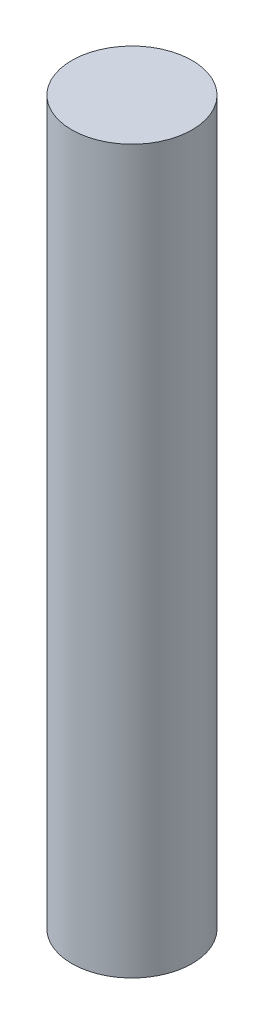
ISO-10303-21;
HEADER;
FILE_DESCRIPTION(('STEP AP214'),'2;1');
FILE_NAME('part.step','',(''),(''),'','','');
FILE_SCHEMA(('AUTOMOTIVE_DESIGN { 1 0 10303 214 1 1 1 1 }'));
ENDSEC;
DATA;
#1=APPLICATION_CONTEXT('core data for automotive mechanical design processes');
#2=APPLICATION_PROTOCOL_DEFINITION('international standard','automotive_design',2000,#1);
#3=PRODUCT_CONTEXT('',#1,'mechanical');
#4=PRODUCT('Part','Part','',(#3));
#5=PRODUCT_RELATED_PRODUCT_CATEGORY('part','',(#4));
#6=PRODUCT_DEFINITION_FORMATION('','',#4);
#7=PRODUCT_DEFINITION_CONTEXT('part definition',#1,'design');
#8=PRODUCT_DEFINITION('design','',#6,#7);
#9=PRODUCT_DEFINITION_SHAPE('','',#8);
#10=(LENGTH_UNIT() NAMED_UNIT(*) SI_UNIT(.MILLI.,.METRE.));
#11=(NAMED_UNIT(*) PLANE_ANGLE_UNIT() SI_UNIT($,.RADIAN.));
#12=(NAMED_UNIT(*) SI_UNIT($,.STERADIAN.) SOLID_ANGLE_UNIT());
#13=UNCERTAINTY_MEASURE_WITH_UNIT(LENGTH_MEASURE(1.E-05),#10,'distance_accuracy_value','');
#14=(GEOMETRIC_REPRESENTATION_CONTEXT(3) GLOBAL_UNCERTAINTY_ASSIGNED_CONTEXT((#13)) GLOBAL_UNIT_ASSIGNED_CONTEXT((#10,
#11,#12)) REPRESENTATION_CONTEXT('',''));
#15=CARTESIAN_POINT('',(0.,0.,0.));
#16=DIRECTION('',(0.,0.,1.));
#17=DIRECTION('',(1.,0.,0.));
#18=AXIS2_PLACEMENT_3D('',#15,#16,#17);
#19=CARTESIAN_POINT('',(0.,22.5,0.));
#20=DIRECTION('',(0.,-1.,0.));
#21=DIRECTION('',(0.,0.,-1.));
#22=AXIS2_PLACEMENT_3D('',#19,#20,#21);
#23=CYLINDRICAL_SURFACE('',#22,1.875);
#24=CARTESIAN_POINT('',(0.,22.5,0.));
#25=DIRECTION('',(0.,1.,0.));
#26=DIRECTION('',(0.,0.,1.));
#27=AXIS2_PLACEMENT_3D('',#24,#25,#26);
#28=CIRCLE('',#27,1.875);
#29=CARTESIAN_POINT('',(0.,22.5,1.875));
#30=VERTEX_POINT('',#29);
#31=EDGE_CURVE('E10',#30,#30,#28,.T.);
#32=ORIENTED_EDGE('',*,*,#31,.F.);
#33=EDGE_LOOP('',(#32));
#34=FACE_BOUND('',#33,.T.);
#35=CARTESIAN_POINT('',(0.,0.,0.));
#36=DIRECTION('',(0.,1.,0.));
#37=DIRECTION('',(0.,0.,1.));
#38=AXIS2_PLACEMENT_3D('',#35,#36,#37);
#39=CIRCLE('',#38,1.875);
#40=CARTESIAN_POINT('',(0.,0.,1.875));
#41=VERTEX_POINT('',#40);
#42=EDGE_CURVE('E34',#41,#41,#39,.T.);
#43=ORIENTED_EDGE('',*,*,#42,.T.);
#44=EDGE_LOOP('',(#43));
#45=FACE_BOUND('',#44,.T.);
#46=ADVANCED_FACE('F31',(#34,#45),#23,.T.);
#47=CARTESIAN_POINT('',(0.,22.5,0.));
#48=DIRECTION('',(0.,1.,0.));
#49=DIRECTION('',(0.,0.,1.));
#50=AXIS2_PLACEMENT_3D('',#47,#48,#49);
#51=PLANE('',#50);
#52=ORIENTED_EDGE('',*,*,#31,.T.);
#53=EDGE_LOOP('',(#52));
#54=FACE_BOUND('',#53,.T.);
#55=ADVANCED_FACE('F46',(#54),#51,.T.);
#56=CARTESIAN_POINT('',(0.,0.,0.));
#57=DIRECTION('',(0.,1.,0.));
#58=DIRECTION('',(0.,0.,1.));
#59=AXIS2_PLACEMENT_3D('',#56,#57,#58);
#60=PLANE('',#59);
#61=ORIENTED_EDGE('',*,*,#42,.F.);
#62=EDGE_LOOP('',(#61));
#63=FACE_BOUND('',#62,.T.);
#64=ADVANCED_FACE('F44',(#63),#60,.F.);
#65=CLOSED_SHELL('',(#46,#55,#64));
#66=MANIFOLD_SOLID_BREP('B2',#65);
#67=ADVANCED_BREP_SHAPE_REPRESENTATION('',(#18,#66),#14);
#68=SHAPE_DEFINITION_REPRESENTATION(#9,#67);
ENDSEC;
END-ISO-10303-21;
